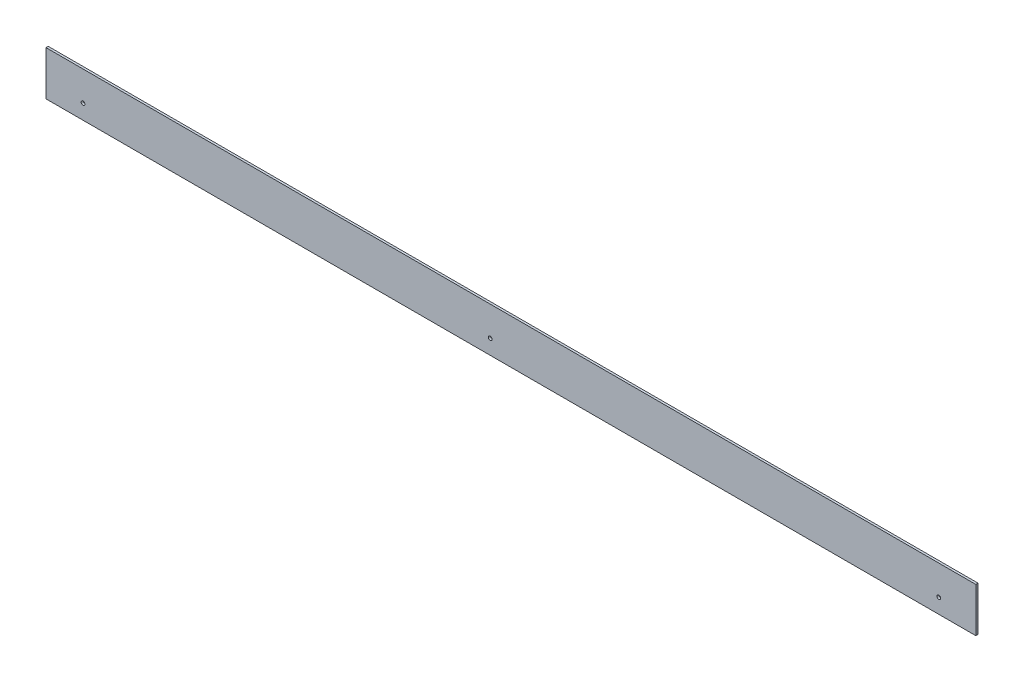
ISO-10303-21;
HEADER;
FILE_DESCRIPTION(('STEP AP214'),'2;1');
FILE_NAME('part.step','',(''),(''),'','','');
FILE_SCHEMA(('AUTOMOTIVE_DESIGN { 1 0 10303 214 1 1 1 1 }'));
ENDSEC;
DATA;
#1=APPLICATION_CONTEXT('core data for automotive mechanical design processes');
#2=APPLICATION_PROTOCOL_DEFINITION('international standard','automotive_design',2000,#1);
#3=PRODUCT_CONTEXT('',#1,'mechanical');
#4=PRODUCT('Part','Part','',(#3));
#5=PRODUCT_RELATED_PRODUCT_CATEGORY('part','',(#4));
#6=PRODUCT_DEFINITION_FORMATION('','',#4);
#7=PRODUCT_DEFINITION_CONTEXT('part definition',#1,'design');
#8=PRODUCT_DEFINITION('design','',#6,#7);
#9=PRODUCT_DEFINITION_SHAPE('','',#8);
#10=(LENGTH_UNIT() NAMED_UNIT(*) SI_UNIT(.MILLI.,.METRE.));
#11=(NAMED_UNIT(*) PLANE_ANGLE_UNIT() SI_UNIT($,.RADIAN.));
#12=(NAMED_UNIT(*) SI_UNIT($,.STERADIAN.) SOLID_ANGLE_UNIT());
#13=UNCERTAINTY_MEASURE_WITH_UNIT(LENGTH_MEASURE(1.E-05),#10,'distance_accuracy_value','');
#14=(GEOMETRIC_REPRESENTATION_CONTEXT(3) GLOBAL_UNCERTAINTY_ASSIGNED_CONTEXT((#13)) GLOBAL_UNIT_ASSIGNED_CONTEXT((#10,
#11,#12)) REPRESENTATION_CONTEXT('',''));
#15=CARTESIAN_POINT('',(0.,0.,0.));
#16=DIRECTION('',(0.,0.,1.));
#17=DIRECTION('',(1.,0.,0.));
#18=AXIS2_PLACEMENT_3D('',#15,#16,#17);
#19=CARTESIAN_POINT('',(0.,0.,3.));
#20=DIRECTION('',(0.,0.,1.));
#21=DIRECTION('',(1.,0.,0.));
#22=AXIS2_PLACEMENT_3D('',#19,#20,#21);
#23=PLANE('',#22);
#24=CARTESIAN_POINT('',(578.,-10.,3.));
#25=DIRECTION('',(0.,0.,1.));
#26=DIRECTION('',(1.,0.,0.));
#27=AXIS2_PLACEMENT_3D('',#24,#25,#26);
#28=CIRCLE('',#27,2.55000000000005);
#29=CARTESIAN_POINT('',(580.55,-10.,3.));
#30=VERTEX_POINT('',#29);
#31=EDGE_CURVE('E114',#30,#30,#28,.T.);
#32=ORIENTED_EDGE('',*,*,#31,.F.);
#33=EDGE_LOOP('',(#32));
#34=FACE_BOUND('',#33,.T.);
#35=DIRECTION('',(0.,1.,0.));
#36=VECTOR('',#35,1.);
#37=CARTESIAN_POINT('',(628.,30.,3.));
#38=LINE('',#37,#36);
#39=CARTESIAN_POINT('',(628.,-30.,3.));
#40=VERTEX_POINT('',#39);
#41=CARTESIAN_POINT('',(628.,30.,3.));
#42=VERTEX_POINT('',#41);
#43=EDGE_CURVE('E84',#40,#42,#38,.T.);
#44=ORIENTED_EDGE('',*,*,#43,.T.);
#45=DIRECTION('',(-1.,0.,0.));
#46=VECTOR('',#45,1.);
#47=CARTESIAN_POINT('',(-628.,30.,3.));
#48=LINE('',#47,#46);
#49=CARTESIAN_POINT('',(-628.,30.,3.));
#50=VERTEX_POINT('',#49);
#51=EDGE_CURVE('E79',#42,#50,#48,.T.);
#52=ORIENTED_EDGE('',*,*,#51,.T.);
#53=DIRECTION('',(0.,-1.,0.));
#54=VECTOR('',#53,1.);
#55=CARTESIAN_POINT('',(-628.,30.,3.));
#56=LINE('',#55,#54);
#57=CARTESIAN_POINT('',(-628.,-30.,3.));
#58=VERTEX_POINT('',#57);
#59=EDGE_CURVE('E82',#50,#58,#56,.T.);
#60=ORIENTED_EDGE('',*,*,#59,.T.);
#61=DIRECTION('',(1.,0.,0.));
#62=VECTOR('',#61,1.);
#63=CARTESIAN_POINT('',(-628.,-30.,3.));
#64=LINE('',#63,#62);
#65=EDGE_CURVE('E49',#58,#40,#64,.T.);
#66=ORIENTED_EDGE('',*,*,#65,.T.);
#67=EDGE_LOOP('',(#44,#52,#60,#66));
#68=FACE_BOUND('',#67,.T.);
#69=CARTESIAN_POINT('',(-28.0000000000001,-10.,3.));
#70=DIRECTION('',(0.,0.,1.));
#71=DIRECTION('',(1.,0.,0.));
#72=AXIS2_PLACEMENT_3D('',#69,#70,#71);
#73=CIRCLE('',#72,2.54999999999999);
#74=CARTESIAN_POINT('',(-25.4500000000001,-10.,3.));
#75=VERTEX_POINT('',#74);
#76=EDGE_CURVE('E99',#75,#75,#73,.T.);
#77=ORIENTED_EDGE('',*,*,#76,.F.);
#78=EDGE_LOOP('',(#77));
#79=FACE_BOUND('',#78,.T.);
#80=CARTESIAN_POINT('',(-578.,-10.,3.));
#81=DIRECTION('',(0.,0.,1.));
#82=DIRECTION('',(1.,0.,0.));
#83=AXIS2_PLACEMENT_3D('',#80,#81,#82);
#84=CIRCLE('',#83,2.55000000000005);
#85=CARTESIAN_POINT('',(-575.45,-10.,3.));
#86=VERTEX_POINT('',#85);
#87=EDGE_CURVE('E120',#86,#86,#84,.T.);
#88=ORIENTED_EDGE('',*,*,#87,.F.);
#89=EDGE_LOOP('',(#88));
#90=FACE_BOUND('',#89,.T.);
#91=ADVANCED_FACE('F32',(#34,#68,#79,#90),#23,.T.);
#92=CARTESIAN_POINT('',(0.,0.,0.));
#93=DIRECTION('',(0.,0.,1.));
#94=DIRECTION('',(1.,0.,0.));
#95=AXIS2_PLACEMENT_3D('',#92,#93,#94);
#96=PLANE('',#95);
#97=DIRECTION('',(0.,1.,0.));
#98=VECTOR('',#97,1.);
#99=CARTESIAN_POINT('',(628.,30.,0.));
#100=LINE('',#99,#98);
#101=CARTESIAN_POINT('',(628.,-30.,0.));
#102=VERTEX_POINT('',#101);
#103=CARTESIAN_POINT('',(628.,30.,0.));
#104=VERTEX_POINT('',#103);
#105=EDGE_CURVE('E96',#102,#104,#100,.T.);
#106=ORIENTED_EDGE('',*,*,#105,.F.);
#107=DIRECTION('',(1.,0.,0.));
#108=VECTOR('',#107,1.);
#109=CARTESIAN_POINT('',(-628.,-30.,0.));
#110=LINE('',#109,#108);
#111=CARTESIAN_POINT('',(-628.,-30.,0.));
#112=VERTEX_POINT('',#111);
#113=EDGE_CURVE('E72',#112,#102,#110,.T.);
#114=ORIENTED_EDGE('',*,*,#113,.F.);
#115=DIRECTION('',(0.,-1.,0.));
#116=VECTOR('',#115,1.);
#117=CARTESIAN_POINT('',(-628.,30.,0.));
#118=LINE('',#117,#116);
#119=CARTESIAN_POINT('',(-628.,30.,0.));
#120=VERTEX_POINT('',#119);
#121=EDGE_CURVE('E66',#120,#112,#118,.T.);
#122=ORIENTED_EDGE('',*,*,#121,.F.);
#123=DIRECTION('',(-1.,0.,0.));
#124=VECTOR('',#123,1.);
#125=CARTESIAN_POINT('',(-628.,30.,0.));
#126=LINE('',#125,#124);
#127=EDGE_CURVE('E88',#104,#120,#126,.T.);
#128=ORIENTED_EDGE('',*,*,#127,.F.);
#129=EDGE_LOOP('',(#106,#114,#122,#128));
#130=FACE_BOUND('',#129,.T.);
#131=CARTESIAN_POINT('',(-28.0000000000001,-10.,0.));
#132=DIRECTION('',(0.,0.,1.));
#133=DIRECTION('',(1.,0.,0.));
#134=AXIS2_PLACEMENT_3D('',#131,#132,#133);
#135=CIRCLE('',#134,2.54999999999999);
#136=CARTESIAN_POINT('',(-25.4500000000001,-10.,0.));
#137=VERTEX_POINT('',#136);
#138=EDGE_CURVE('E111',#137,#137,#135,.T.);
#139=ORIENTED_EDGE('',*,*,#138,.T.);
#140=EDGE_LOOP('',(#139));
#141=FACE_BOUND('',#140,.T.);
#142=CARTESIAN_POINT('',(578.,-10.,0.));
#143=DIRECTION('',(0.,0.,1.));
#144=DIRECTION('',(1.,0.,0.));
#145=AXIS2_PLACEMENT_3D('',#142,#143,#144);
#146=CIRCLE('',#145,2.55000000000005);
#147=CARTESIAN_POINT('',(580.55,-10.,0.));
#148=VERTEX_POINT('',#147);
#149=EDGE_CURVE('E117',#148,#148,#146,.T.);
#150=ORIENTED_EDGE('',*,*,#149,.T.);
#151=EDGE_LOOP('',(#150));
#152=FACE_BOUND('',#151,.T.);
#153=CARTESIAN_POINT('',(-578.,-10.,0.));
#154=DIRECTION('',(0.,0.,1.));
#155=DIRECTION('',(1.,0.,0.));
#156=AXIS2_PLACEMENT_3D('',#153,#154,#155);
#157=CIRCLE('',#156,2.55000000000005);
#158=CARTESIAN_POINT('',(-575.45,-10.,0.));
#159=VERTEX_POINT('',#158);
#160=EDGE_CURVE('E123',#159,#159,#157,.T.);
#161=ORIENTED_EDGE('',*,*,#160,.T.);
#162=EDGE_LOOP('',(#161));
#163=FACE_BOUND('',#162,.T.);
#164=ADVANCED_FACE('F107',(#130,#141,#152,#163),#96,.F.);
#165=CARTESIAN_POINT('',(628.,30.,3.));
#166=DIRECTION('',(-1.,0.,0.));
#167=DIRECTION('',(0.,-1.,0.));
#168=AXIS2_PLACEMENT_3D('',#165,#166,#167);
#169=PLANE('',#168);
#170=ORIENTED_EDGE('',*,*,#105,.T.);
#171=DIRECTION('',(0.,0.,-1.));
#172=VECTOR('',#171,1.);
#173=CARTESIAN_POINT('',(628.,30.,3.));
#174=LINE('',#173,#172);
#175=EDGE_CURVE('E11',#42,#104,#174,.T.);
#176=ORIENTED_EDGE('',*,*,#175,.F.);
#177=ORIENTED_EDGE('',*,*,#43,.F.);
#178=DIRECTION('',(0.,0.,-1.));
#179=VECTOR('',#178,1.);
#180=CARTESIAN_POINT('',(628.,-30.,3.));
#181=LINE('',#180,#179);
#182=EDGE_CURVE('E92',#40,#102,#181,.T.);
#183=ORIENTED_EDGE('',*,*,#182,.T.);
#184=EDGE_LOOP('',(#170,#176,#177,#183));
#185=FACE_BOUND('',#184,.T.);
#186=ADVANCED_FACE('F34',(#185),#169,.F.);
#187=CARTESIAN_POINT('',(-628.,30.,3.));
#188=DIRECTION('',(0.,-1.,0.));
#189=DIRECTION('',(0.,0.,-1.));
#190=AXIS2_PLACEMENT_3D('',#187,#188,#189);
#191=PLANE('',#190);
#192=ORIENTED_EDGE('',*,*,#127,.T.);
#193=DIRECTION('',(0.,0.,-1.));
#194=VECTOR('',#193,1.);
#195=CARTESIAN_POINT('',(-628.,30.,3.));
#196=LINE('',#195,#194);
#197=EDGE_CURVE('E41',#50,#120,#196,.T.);
#198=ORIENTED_EDGE('',*,*,#197,.F.);
#199=ORIENTED_EDGE('',*,*,#51,.F.);
#200=ORIENTED_EDGE('',*,*,#175,.T.);
#201=EDGE_LOOP('',(#192,#198,#199,#200));
#202=FACE_BOUND('',#201,.T.);
#203=ADVANCED_FACE('F87',(#202),#191,.F.);
#204=CARTESIAN_POINT('',(-628.,30.,3.));
#205=DIRECTION('',(1.,0.,0.));
#206=DIRECTION('',(0.,1.,0.));
#207=AXIS2_PLACEMENT_3D('',#204,#205,#206);
#208=PLANE('',#207);
#209=ORIENTED_EDGE('',*,*,#121,.T.);
#210=DIRECTION('',(0.,0.,-1.));
#211=VECTOR('',#210,1.);
#212=CARTESIAN_POINT('',(-628.,-30.,3.));
#213=LINE('',#212,#211);
#214=EDGE_CURVE('E89',#58,#112,#213,.T.);
#215=ORIENTED_EDGE('',*,*,#214,.F.);
#216=ORIENTED_EDGE('',*,*,#59,.F.);
#217=ORIENTED_EDGE('',*,*,#197,.T.);
#218=EDGE_LOOP('',(#209,#215,#216,#217));
#219=FACE_BOUND('',#218,.T.);
#220=ADVANCED_FACE('F90',(#219),#208,.F.);
#221=CARTESIAN_POINT('',(-628.,-30.,3.));
#222=DIRECTION('',(0.,1.,0.));
#223=DIRECTION('',(0.,0.,1.));
#224=AXIS2_PLACEMENT_3D('',#221,#222,#223);
#225=PLANE('',#224);
#226=ORIENTED_EDGE('',*,*,#113,.T.);
#227=ORIENTED_EDGE('',*,*,#182,.F.);
#228=ORIENTED_EDGE('',*,*,#65,.F.);
#229=ORIENTED_EDGE('',*,*,#214,.T.);
#230=EDGE_LOOP('',(#226,#227,#228,#229));
#231=FACE_BOUND('',#230,.T.);
#232=ADVANCED_FACE('F104',(#231),#225,.F.);
#233=CARTESIAN_POINT('',(-28.0000000000001,-10.,3.));
#234=DIRECTION('',(0.,0.,-1.));
#235=DIRECTION('',(-1.,0.,0.));
#236=AXIS2_PLACEMENT_3D('',#233,#234,#235);
#237=CYLINDRICAL_SURFACE('',#236,2.54999999999999);
#238=ORIENTED_EDGE('',*,*,#76,.T.);
#239=EDGE_LOOP('',(#238));
#240=FACE_BOUND('',#239,.T.);
#241=ORIENTED_EDGE('',*,*,#138,.F.);
#242=EDGE_LOOP('',(#241));
#243=FACE_BOUND('',#242,.T.);
#244=ADVANCED_FACE('F141',(#240,#243),#237,.F.);
#245=CARTESIAN_POINT('',(578.,-10.,3.));
#246=DIRECTION('',(0.,0.,-1.));
#247=DIRECTION('',(-1.,0.,0.));
#248=AXIS2_PLACEMENT_3D('',#245,#246,#247);
#249=CYLINDRICAL_SURFACE('',#248,2.55000000000005);
#250=ORIENTED_EDGE('',*,*,#31,.T.);
#251=EDGE_LOOP('',(#250));
#252=FACE_BOUND('',#251,.T.);
#253=ORIENTED_EDGE('',*,*,#149,.F.);
#254=EDGE_LOOP('',(#253));
#255=FACE_BOUND('',#254,.T.);
#256=ADVANCED_FACE('F187',(#252,#255),#249,.F.);
#257=CARTESIAN_POINT('',(-578.,-10.,3.));
#258=DIRECTION('',(0.,0.,-1.));
#259=DIRECTION('',(-1.,0.,0.));
#260=AXIS2_PLACEMENT_3D('',#257,#258,#259);
#261=CYLINDRICAL_SURFACE('',#260,2.55000000000005);
#262=ORIENTED_EDGE('',*,*,#87,.T.);
#263=EDGE_LOOP('',(#262));
#264=FACE_BOUND('',#263,.T.);
#265=ORIENTED_EDGE('',*,*,#160,.F.);
#266=EDGE_LOOP('',(#265));
#267=FACE_BOUND('',#266,.T.);
#268=ADVANCED_FACE('F129',(#264,#267),#261,.F.);
#269=CLOSED_SHELL('',(#91,#164,#186,#203,#220,#232,#244,#256,#268));
#270=MANIFOLD_SOLID_BREP('B2',#269);
#271=ADVANCED_BREP_SHAPE_REPRESENTATION('',(#18,#270),#14);
#272=SHAPE_DEFINITION_REPRESENTATION(#9,#271);
ENDSEC;
END-ISO-10303-21;
